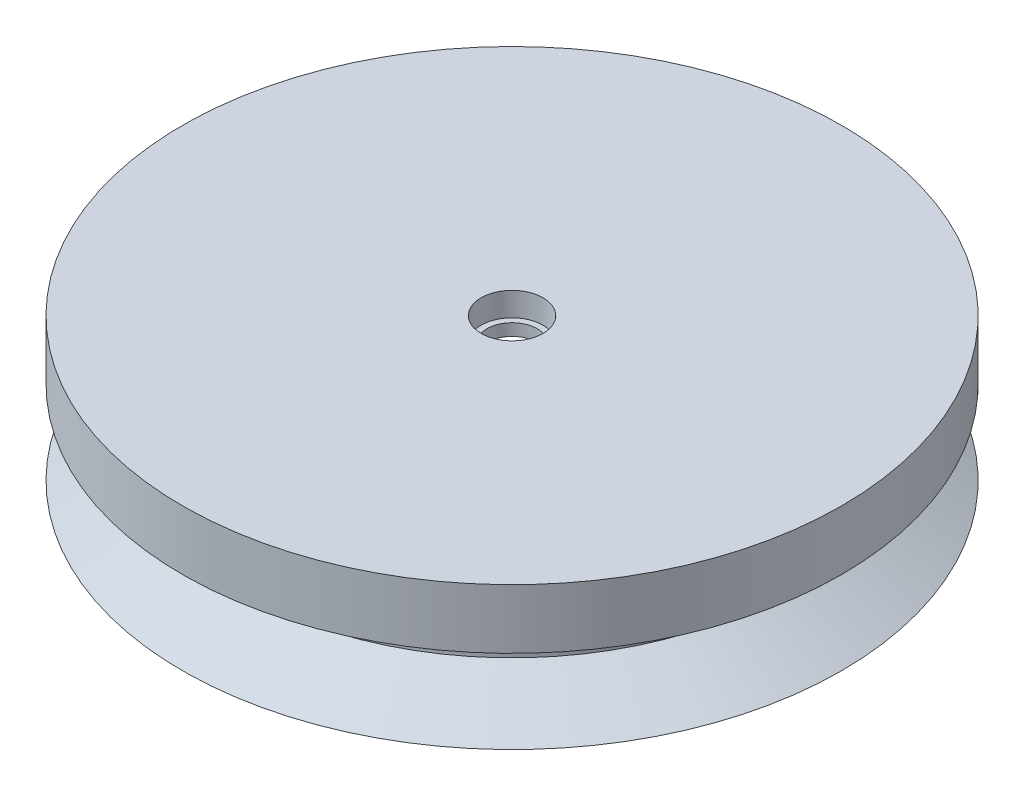
ISO-10303-21;
HEADER;
FILE_DESCRIPTION(('STEP AP214'),'2;1');
FILE_NAME('part.step','',(''),(''),'','','');
FILE_SCHEMA(('AUTOMOTIVE_DESIGN { 1 0 10303 214 1 1 1 1 }'));
ENDSEC;
DATA;
#1=APPLICATION_CONTEXT('core data for automotive mechanical design processes');
#2=APPLICATION_PROTOCOL_DEFINITION('international standard','automotive_design',2000,#1);
#3=PRODUCT_CONTEXT('',#1,'mechanical');
#4=PRODUCT('Part','Part','',(#3));
#5=PRODUCT_RELATED_PRODUCT_CATEGORY('part','',(#4));
#6=PRODUCT_DEFINITION_FORMATION('','',#4);
#7=PRODUCT_DEFINITION_CONTEXT('part definition',#1,'design');
#8=PRODUCT_DEFINITION('design','',#6,#7);
#9=PRODUCT_DEFINITION_SHAPE('','',#8);
#10=(LENGTH_UNIT() NAMED_UNIT(*) SI_UNIT(.MILLI.,.METRE.));
#11=(NAMED_UNIT(*) PLANE_ANGLE_UNIT() SI_UNIT($,.RADIAN.));
#12=(NAMED_UNIT(*) SI_UNIT($,.STERADIAN.) SOLID_ANGLE_UNIT());
#13=UNCERTAINTY_MEASURE_WITH_UNIT(LENGTH_MEASURE(1.E-05),#10,'distance_accuracy_value','');
#14=(GEOMETRIC_REPRESENTATION_CONTEXT(3) GLOBAL_UNCERTAINTY_ASSIGNED_CONTEXT((#13)) GLOBAL_UNIT_ASSIGNED_CONTEXT((#10,
#11,#12)) REPRESENTATION_CONTEXT('',''));
#15=CARTESIAN_POINT('',(0.,0.,0.));
#16=DIRECTION('',(0.,0.,1.));
#17=DIRECTION('',(1.,0.,0.));
#18=AXIS2_PLACEMENT_3D('',#15,#16,#17);
#19=CARTESIAN_POINT('',(0.,0.,0.));
#20=DIRECTION('',(0.,-1.,0.));
#21=DIRECTION('',(1.,0.,0.));
#22=AXIS2_PLACEMENT_3D('',#19,#20,#21);
#23=CYLINDRICAL_SURFACE('',#22,2.6);
#24=CARTESIAN_POINT('',(0.,1.,0.));
#25=DIRECTION('',(0.,-1.,0.));
#26=DIRECTION('',(1.,0.,0.));
#27=AXIS2_PLACEMENT_3D('',#24,#25,#26);
#28=CIRCLE('',#27,2.6);
#29=CARTESIAN_POINT('',(2.6,1.,0.));
#30=VERTEX_POINT('',#29);
#31=EDGE_CURVE('E80',#30,#30,#28,.T.);
#32=ORIENTED_EDGE('',*,*,#31,.T.);
#33=EDGE_LOOP('',(#32));
#34=FACE_BOUND('',#33,.T.);
#35=CARTESIAN_POINT('',(0.,3.,0.));
#36=DIRECTION('',(0.,-1.,0.));
#37=DIRECTION('',(1.,0.,0.));
#38=AXIS2_PLACEMENT_3D('',#35,#36,#37);
#39=CIRCLE('',#38,2.6);
#40=CARTESIAN_POINT('',(2.6,3.,0.));
#41=VERTEX_POINT('',#40);
#42=EDGE_CURVE('E10',#41,#41,#39,.T.);
#43=ORIENTED_EDGE('',*,*,#42,.F.);
#44=EDGE_LOOP('',(#43));
#45=FACE_BOUND('',#44,.T.);
#46=ADVANCED_FACE('F37',(#34,#45),#23,.F.);
#47=CARTESIAN_POINT('',(2.6,3.,0.));
#48=DIRECTION('',(0.,1.,0.));
#49=DIRECTION('',(-1.,0.,0.));
#50=AXIS2_PLACEMENT_3D('',#47,#48,#49);
#51=PLANE('',#50);
#52=ORIENTED_EDGE('',*,*,#42,.T.);
#53=EDGE_LOOP('',(#52));
#54=FACE_BOUND('',#53,.T.);
#55=CARTESIAN_POINT('',(0.,3.,0.));
#56=DIRECTION('',(0.,-1.,0.));
#57=DIRECTION('',(1.,0.,0.));
#58=AXIS2_PLACEMENT_3D('',#55,#56,#57);
#59=CIRCLE('',#58,27.6961524227067);
#60=CARTESIAN_POINT('',(27.6961524227067,3.,0.));
#61=VERTEX_POINT('',#60);
#62=EDGE_CURVE('E43',#61,#61,#59,.T.);
#63=ORIENTED_EDGE('',*,*,#62,.F.);
#64=EDGE_LOOP('',(#63));
#65=FACE_BOUND('',#64,.T.);
#66=ADVANCED_FACE('F98',(#54,#65),#51,.T.);
#67=CARTESIAN_POINT('',(0.,0.,0.));
#68=DIRECTION('',(0.,-1.,0.));
#69=DIRECTION('',(1.,0.,0.));
#70=AXIS2_PLACEMENT_3D('',#67,#68,#69);
#71=CYLINDRICAL_SURFACE('',#70,27.6961524227067);
#72=ORIENTED_EDGE('',*,*,#62,.T.);
#73=EDGE_LOOP('',(#72));
#74=FACE_BOUND('',#73,.T.);
#75=CARTESIAN_POINT('',(0.,-2.,0.));
#76=DIRECTION('',(0.,-1.,0.));
#77=DIRECTION('',(1.,0.,0.));
#78=AXIS2_PLACEMENT_3D('',#75,#76,#77);
#79=CIRCLE('',#78,27.6961524227067);
#80=CARTESIAN_POINT('',(27.6961524227067,-2.,0.));
#81=VERTEX_POINT('',#80);
#82=EDGE_CURVE('E47',#81,#81,#79,.T.);
#83=ORIENTED_EDGE('',*,*,#82,.F.);
#84=EDGE_LOOP('',(#83));
#85=FACE_BOUND('',#84,.T.);
#86=ADVANCED_FACE('F102',(#74,#85),#71,.T.);
#87=CARTESIAN_POINT('',(0.,-5.,0.));
#88=DIRECTION('',(0.,1.,0.));
#89=DIRECTION('',(-1.,0.,0.));
#90=AXIS2_PLACEMENT_3D('',#87,#88,#89);
#91=CONICAL_SURFACE('',#90,22.5,1.0471975511966);
#92=ORIENTED_EDGE('',*,*,#82,.T.);
#93=EDGE_LOOP('',(#92));
#94=FACE_BOUND('',#93,.T.);
#95=CARTESIAN_POINT('',(0.,-5.,0.));
#96=DIRECTION('',(0.,-1.,0.));
#97=DIRECTION('',(1.,0.,0.));
#98=AXIS2_PLACEMENT_3D('',#95,#96,#97);
#99=CIRCLE('',#98,22.5);
#100=CARTESIAN_POINT('',(22.5,-5.,0.));
#101=VERTEX_POINT('',#100);
#102=EDGE_CURVE('E51',#101,#101,#99,.T.);
#103=ORIENTED_EDGE('',*,*,#102,.F.);
#104=EDGE_LOOP('',(#103));
#105=FACE_BOUND('',#104,.T.);
#106=ADVANCED_FACE('F106',(#94,#105),#91,.T.);
#107=CARTESIAN_POINT('',(0.,0.,0.));
#108=DIRECTION('',(0.,-1.,0.));
#109=DIRECTION('',(1.,0.,0.));
#110=AXIS2_PLACEMENT_3D('',#107,#108,#109);
#111=CYLINDRICAL_SURFACE('',#110,22.5);
#112=ORIENTED_EDGE('',*,*,#102,.T.);
#113=EDGE_LOOP('',(#112));
#114=FACE_BOUND('',#113,.T.);
#115=CARTESIAN_POINT('',(0.,-6.,0.));
#116=DIRECTION('',(0.,-1.,0.));
#117=DIRECTION('',(1.,0.,0.));
#118=AXIS2_PLACEMENT_3D('',#115,#116,#117);
#119=CIRCLE('',#118,22.5);
#120=CARTESIAN_POINT('',(22.5,-6.,0.));
#121=VERTEX_POINT('',#120);
#122=EDGE_CURVE('E56',#121,#121,#119,.T.);
#123=ORIENTED_EDGE('',*,*,#122,.F.);
#124=EDGE_LOOP('',(#123));
#125=FACE_BOUND('',#124,.T.);
#126=ADVANCED_FACE('F112',(#114,#125),#111,.T.);
#127=CARTESIAN_POINT('',(0.,-9.,0.));
#128=DIRECTION('',(0.,-1.,0.));
#129=DIRECTION('',(1.,0.,0.));
#130=AXIS2_PLACEMENT_3D('',#127,#128,#129);
#131=CONICAL_SURFACE('',#130,27.6961524227067,1.0471975511966);
#132=ORIENTED_EDGE('',*,*,#122,.T.);
#133=EDGE_LOOP('',(#132));
#134=FACE_BOUND('',#133,.T.);
#135=CARTESIAN_POINT('',(0.,-9.,0.));
#136=DIRECTION('',(0.,-1.,0.));
#137=DIRECTION('',(1.,0.,0.));
#138=AXIS2_PLACEMENT_3D('',#135,#136,#137);
#139=CIRCLE('',#138,27.6961524227067);
#140=CARTESIAN_POINT('',(27.6961524227067,-9.,0.));
#141=VERTEX_POINT('',#140);
#142=EDGE_CURVE('E59',#141,#141,#139,.T.);
#143=ORIENTED_EDGE('',*,*,#142,.F.);
#144=EDGE_LOOP('',(#143));
#145=FACE_BOUND('',#144,.T.);
#146=ADVANCED_FACE('F116',(#134,#145),#131,.T.);
#147=CARTESIAN_POINT('',(21.,-9.,0.));
#148=DIRECTION('',(0.,-1.,0.));
#149=DIRECTION('',(1.,0.,0.));
#150=AXIS2_PLACEMENT_3D('',#147,#148,#149);
#151=PLANE('',#150);
#152=ORIENTED_EDGE('',*,*,#142,.T.);
#153=EDGE_LOOP('',(#152));
#154=FACE_BOUND('',#153,.T.);
#155=CARTESIAN_POINT('',(0.,-9.,0.));
#156=DIRECTION('',(0.,-1.,0.));
#157=DIRECTION('',(1.,0.,0.));
#158=AXIS2_PLACEMENT_3D('',#155,#156,#157);
#159=CIRCLE('',#158,21.);
#160=CARTESIAN_POINT('',(21.,-9.,0.));
#161=VERTEX_POINT('',#160);
#162=EDGE_CURVE('E62',#161,#161,#159,.T.);
#163=ORIENTED_EDGE('',*,*,#162,.F.);
#164=EDGE_LOOP('',(#163));
#165=FACE_BOUND('',#164,.T.);
#166=ADVANCED_FACE('F120',(#154,#165),#151,.T.);
#167=CARTESIAN_POINT('',(0.,0.,0.));
#168=DIRECTION('',(0.,-1.,0.));
#169=DIRECTION('',(1.,0.,0.));
#170=AXIS2_PLACEMENT_3D('',#167,#168,#169);
#171=CYLINDRICAL_SURFACE('',#170,21.);
#172=ORIENTED_EDGE('',*,*,#162,.T.);
#173=EDGE_LOOP('',(#172));
#174=FACE_BOUND('',#173,.T.);
#175=CARTESIAN_POINT('',(0.,-2.,0.));
#176=DIRECTION('',(0.,-1.,0.));
#177=DIRECTION('',(1.,0.,0.));
#178=AXIS2_PLACEMENT_3D('',#175,#176,#177);
#179=CIRCLE('',#178,21.);
#180=CARTESIAN_POINT('',(21.,-2.,0.));
#181=VERTEX_POINT('',#180);
#182=EDGE_CURVE('E65',#181,#181,#179,.T.);
#183=ORIENTED_EDGE('',*,*,#182,.F.);
#184=EDGE_LOOP('',(#183));
#185=FACE_BOUND('',#184,.T.);
#186=ADVANCED_FACE('F124',(#174,#185),#171,.F.);
#187=CARTESIAN_POINT('',(21.,-2.,0.));
#188=DIRECTION('',(0.,-1.,0.));
#189=DIRECTION('',(1.,0.,0.));
#190=AXIS2_PLACEMENT_3D('',#187,#188,#189);
#191=PLANE('',#190);
#192=ORIENTED_EDGE('',*,*,#182,.T.);
#193=EDGE_LOOP('',(#192));
#194=FACE_BOUND('',#193,.T.);
#195=CARTESIAN_POINT('',(0.,-2.,0.));
#196=DIRECTION('',(0.,-1.,0.));
#197=DIRECTION('',(1.,0.,0.));
#198=AXIS2_PLACEMENT_3D('',#195,#196,#197);
#199=CIRCLE('',#198,20.);
#200=CARTESIAN_POINT('',(20.,-2.,0.));
#201=VERTEX_POINT('',#200);
#202=EDGE_CURVE('E68',#201,#201,#199,.T.);
#203=ORIENTED_EDGE('',*,*,#202,.F.);
#204=EDGE_LOOP('',(#203));
#205=FACE_BOUND('',#204,.T.);
#206=ADVANCED_FACE('F128',(#194,#205),#191,.T.);
#207=CARTESIAN_POINT('',(0.,0.,0.));
#208=DIRECTION('',(0.,-1.,0.));
#209=DIRECTION('',(1.,0.,0.));
#210=AXIS2_PLACEMENT_3D('',#207,#208,#209);
#211=CYLINDRICAL_SURFACE('',#210,20.);
#212=ORIENTED_EDGE('',*,*,#202,.T.);
#213=EDGE_LOOP('',(#212));
#214=FACE_BOUND('',#213,.T.);
#215=CARTESIAN_POINT('',(0.,0.,0.));
#216=DIRECTION('',(0.,-1.,0.));
#217=DIRECTION('',(1.,0.,0.));
#218=AXIS2_PLACEMENT_3D('',#215,#216,#217);
#219=CIRCLE('',#218,20.);
#220=CARTESIAN_POINT('',(20.,0.,0.));
#221=VERTEX_POINT('',#220);
#222=EDGE_CURVE('E71',#221,#221,#219,.T.);
#223=ORIENTED_EDGE('',*,*,#222,.F.);
#224=EDGE_LOOP('',(#223));
#225=FACE_BOUND('',#224,.T.);
#226=ADVANCED_FACE('F132',(#214,#225),#211,.F.);
#227=CARTESIAN_POINT('',(2.1,0.,0.));
#228=DIRECTION('',(0.,-1.,0.));
#229=DIRECTION('',(1.,0.,0.));
#230=AXIS2_PLACEMENT_3D('',#227,#228,#229);
#231=PLANE('',#230);
#232=ORIENTED_EDGE('',*,*,#222,.T.);
#233=EDGE_LOOP('',(#232));
#234=FACE_BOUND('',#233,.T.);
#235=CARTESIAN_POINT('',(0.,0.,0.));
#236=DIRECTION('',(0.,-1.,0.));
#237=DIRECTION('',(1.,0.,0.));
#238=AXIS2_PLACEMENT_3D('',#235,#236,#237);
#239=CIRCLE('',#238,2.1);
#240=CARTESIAN_POINT('',(2.1,0.,0.));
#241=VERTEX_POINT('',#240);
#242=EDGE_CURVE('E74',#241,#241,#239,.T.);
#243=ORIENTED_EDGE('',*,*,#242,.F.);
#244=EDGE_LOOP('',(#243));
#245=FACE_BOUND('',#244,.T.);
#246=ADVANCED_FACE('F94',(#234,#245),#231,.T.);
#247=CARTESIAN_POINT('',(0.,0.,0.));
#248=DIRECTION('',(0.,-1.,0.));
#249=DIRECTION('',(1.,0.,0.));
#250=AXIS2_PLACEMENT_3D('',#247,#248,#249);
#251=CYLINDRICAL_SURFACE('',#250,2.1);
#252=ORIENTED_EDGE('',*,*,#242,.T.);
#253=EDGE_LOOP('',(#252));
#254=FACE_BOUND('',#253,.T.);
#255=CARTESIAN_POINT('',(0.,1.,0.));
#256=DIRECTION('',(0.,-1.,0.));
#257=DIRECTION('',(1.,0.,0.));
#258=AXIS2_PLACEMENT_3D('',#255,#256,#257);
#259=CIRCLE('',#258,2.1);
#260=CARTESIAN_POINT('',(2.1,1.,0.));
#261=VERTEX_POINT('',#260);
#262=EDGE_CURVE('E77',#261,#261,#259,.T.);
#263=ORIENTED_EDGE('',*,*,#262,.F.);
#264=EDGE_LOOP('',(#263));
#265=FACE_BOUND('',#264,.T.);
#266=ADVANCED_FACE('F88',(#254,#265),#251,.F.);
#267=CARTESIAN_POINT('',(2.1,1.,0.));
#268=DIRECTION('',(0.,1.,0.));
#269=DIRECTION('',(-1.,0.,0.));
#270=AXIS2_PLACEMENT_3D('',#267,#268,#269);
#271=PLANE('',#270);
#272=ORIENTED_EDGE('',*,*,#262,.T.);
#273=EDGE_LOOP('',(#272));
#274=FACE_BOUND('',#273,.T.);
#275=ORIENTED_EDGE('',*,*,#31,.F.);
#276=EDGE_LOOP('',(#275));
#277=FACE_BOUND('',#276,.T.);
#278=ADVANCED_FACE('F86',(#274,#277),#271,.T.);
#279=CLOSED_SHELL('',(#46,#66,#86,#106,#126,#146,#166,#186,#206,#226,#246,#266,#278));
#280=MANIFOLD_SOLID_BREP('B2',#279);
#281=ADVANCED_BREP_SHAPE_REPRESENTATION('',(#18,#280),#14);
#282=SHAPE_DEFINITION_REPRESENTATION(#9,#281);
ENDSEC;
END-ISO-10303-21;
